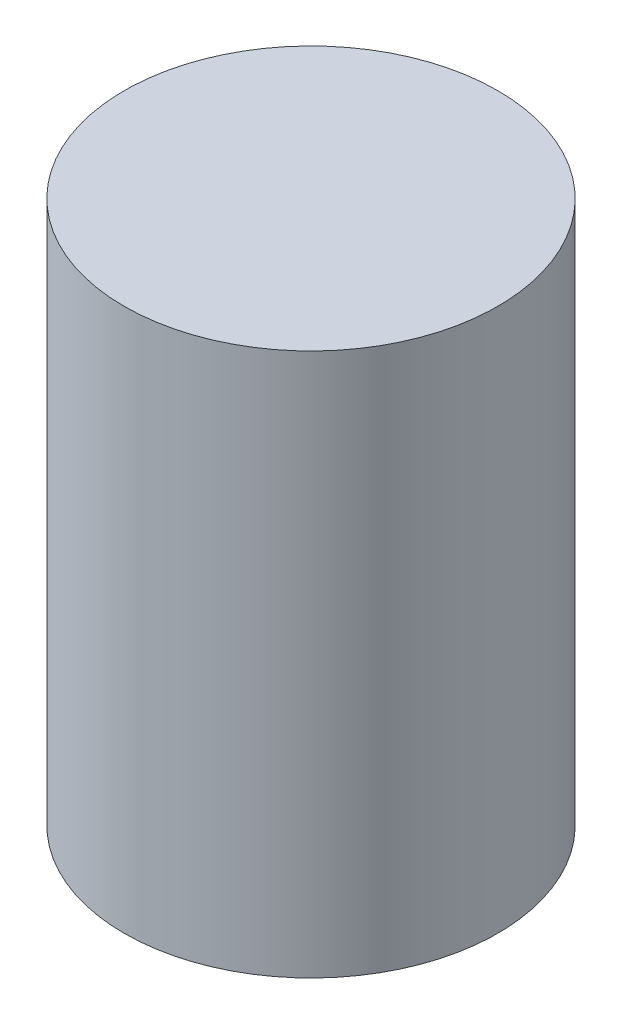
ISO-10303-21;
HEADER;
FILE_DESCRIPTION(('STEP AP214'),'2;1');
FILE_NAME('part.step','',(''),(''),'','','');
FILE_SCHEMA(('AUTOMOTIVE_DESIGN { 1 0 10303 214 1 1 1 1 }'));
ENDSEC;
DATA;
#1=APPLICATION_CONTEXT('core data for automotive mechanical design processes');
#2=APPLICATION_PROTOCOL_DEFINITION('international standard','automotive_design',2000,#1);
#3=PRODUCT_CONTEXT('',#1,'mechanical');
#4=PRODUCT('Part','Part','',(#3));
#5=PRODUCT_RELATED_PRODUCT_CATEGORY('part','',(#4));
#6=PRODUCT_DEFINITION_FORMATION('','',#4);
#7=PRODUCT_DEFINITION_CONTEXT('part definition',#1,'design');
#8=PRODUCT_DEFINITION('design','',#6,#7);
#9=PRODUCT_DEFINITION_SHAPE('','',#8);
#10=(LENGTH_UNIT() NAMED_UNIT(*) SI_UNIT(.MILLI.,.METRE.));
#11=(NAMED_UNIT(*) PLANE_ANGLE_UNIT() SI_UNIT($,.RADIAN.));
#12=(NAMED_UNIT(*) SI_UNIT($,.STERADIAN.) SOLID_ANGLE_UNIT());
#13=UNCERTAINTY_MEASURE_WITH_UNIT(LENGTH_MEASURE(1.E-05),#10,'distance_accuracy_value','');
#14=(GEOMETRIC_REPRESENTATION_CONTEXT(3) GLOBAL_UNCERTAINTY_ASSIGNED_CONTEXT((#13)) GLOBAL_UNIT_ASSIGNED_CONTEXT((#10,
#11,#12)) REPRESENTATION_CONTEXT('',''));
#15=CARTESIAN_POINT('',(0.,0.,0.));
#16=DIRECTION('',(0.,0.,1.));
#17=DIRECTION('',(1.,0.,0.));
#18=AXIS2_PLACEMENT_3D('',#15,#16,#17);
#19=CARTESIAN_POINT('',(0.,1.5875,0.));
#20=DIRECTION('',(0.,-1.,0.));
#21=DIRECTION('',(0.,0.,-1.));
#22=AXIS2_PLACEMENT_3D('',#19,#20,#21);
#23=CYLINDRICAL_SURFACE('',#22,1.0922);
#24=CARTESIAN_POINT('',(0.,1.5875,0.));
#25=DIRECTION('',(0.,1.,0.));
#26=DIRECTION('',(0.,0.,1.));
#27=AXIS2_PLACEMENT_3D('',#24,#25,#26);
#28=CIRCLE('',#27,1.0922);
#29=CARTESIAN_POINT('',(0.,1.5875,1.0922));
#30=VERTEX_POINT('',#29);
#31=EDGE_CURVE('E10',#30,#30,#28,.T.);
#32=ORIENTED_EDGE('',*,*,#31,.F.);
#33=EDGE_LOOP('',(#32));
#34=FACE_BOUND('',#33,.T.);
#35=CARTESIAN_POINT('',(0.,-1.5875,0.));
#36=DIRECTION('',(0.,1.,0.));
#37=DIRECTION('',(0.,0.,1.));
#38=AXIS2_PLACEMENT_3D('',#35,#36,#37);
#39=CIRCLE('',#38,1.0922);
#40=CARTESIAN_POINT('',(0.,-1.5875,1.0922));
#41=VERTEX_POINT('',#40);
#42=EDGE_CURVE('E36',#41,#41,#39,.T.);
#43=ORIENTED_EDGE('',*,*,#42,.T.);
#44=EDGE_LOOP('',(#43));
#45=FACE_BOUND('',#44,.T.);
#46=ADVANCED_FACE('F33',(#34,#45),#23,.T.);
#47=CARTESIAN_POINT('',(0.,1.5875,0.));
#48=DIRECTION('',(0.,1.,0.));
#49=DIRECTION('',(0.,0.,1.));
#50=AXIS2_PLACEMENT_3D('',#47,#48,#49);
#51=PLANE('',#50);
#52=ORIENTED_EDGE('',*,*,#31,.T.);
#53=EDGE_LOOP('',(#52));
#54=FACE_BOUND('',#53,.T.);
#55=ADVANCED_FACE('F48',(#54),#51,.T.);
#56=CARTESIAN_POINT('',(0.,-1.5875,0.));
#57=DIRECTION('',(0.,1.,0.));
#58=DIRECTION('',(0.,0.,1.));
#59=AXIS2_PLACEMENT_3D('',#56,#57,#58);
#60=PLANE('',#59);
#61=ORIENTED_EDGE('',*,*,#42,.F.);
#62=EDGE_LOOP('',(#61));
#63=FACE_BOUND('',#62,.T.);
#64=ADVANCED_FACE('F46',(#63),#60,.F.);
#65=CLOSED_SHELL('',(#46,#55,#64));
#66=MANIFOLD_SOLID_BREP('B2',#65);
#67=ADVANCED_BREP_SHAPE_REPRESENTATION('',(#18,#66),#14);
#68=SHAPE_DEFINITION_REPRESENTATION(#9,#67);
ENDSEC;
END-ISO-10303-21;
